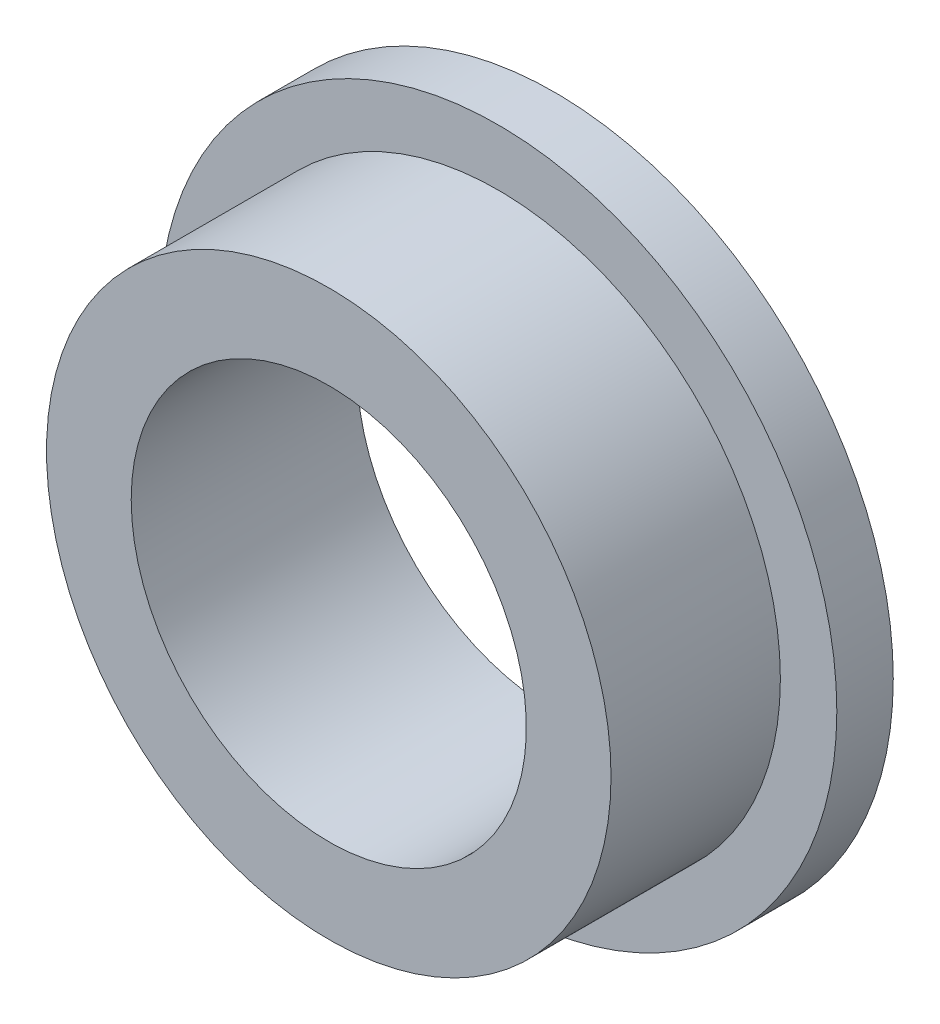
ISO-10303-21;
HEADER;
FILE_DESCRIPTION(('STEP AP214'),'2;1');
FILE_NAME('part.step','',(''),(''),'','','');
FILE_SCHEMA(('AUTOMOTIVE_DESIGN { 1 0 10303 214 1 1 1 1 }'));
ENDSEC;
DATA;
#1=APPLICATION_CONTEXT('core data for automotive mechanical design processes');
#2=APPLICATION_PROTOCOL_DEFINITION('international standard','automotive_design',2000,#1);
#3=PRODUCT_CONTEXT('',#1,'mechanical');
#4=PRODUCT('Part','Part','',(#3));
#5=PRODUCT_RELATED_PRODUCT_CATEGORY('part','',(#4));
#6=PRODUCT_DEFINITION_FORMATION('','',#4);
#7=PRODUCT_DEFINITION_CONTEXT('part definition',#1,'design');
#8=PRODUCT_DEFINITION('design','',#6,#7);
#9=PRODUCT_DEFINITION_SHAPE('','',#8);
#10=(LENGTH_UNIT() NAMED_UNIT(*) SI_UNIT(.MILLI.,.METRE.));
#11=(NAMED_UNIT(*) PLANE_ANGLE_UNIT() SI_UNIT($,.RADIAN.));
#12=(NAMED_UNIT(*) SI_UNIT($,.STERADIAN.) SOLID_ANGLE_UNIT());
#13=UNCERTAINTY_MEASURE_WITH_UNIT(LENGTH_MEASURE(1.E-05),#10,'distance_accuracy_value','');
#14=(GEOMETRIC_REPRESENTATION_CONTEXT(3) GLOBAL_UNCERTAINTY_ASSIGNED_CONTEXT((#13)) GLOBAL_UNIT_ASSIGNED_CONTEXT((#10,
#11,#12)) REPRESENTATION_CONTEXT('',''));
#15=CARTESIAN_POINT('',(0.,0.,0.));
#16=DIRECTION('',(0.,0.,1.));
#17=DIRECTION('',(1.,0.,0.));
#18=AXIS2_PLACEMENT_3D('',#15,#16,#17);
#19=CARTESIAN_POINT('',(0.,0.,1.));
#20=DIRECTION('',(0.,0.,1.));
#21=DIRECTION('',(1.,0.,0.));
#22=AXIS2_PLACEMENT_3D('',#19,#20,#21);
#23=PLANE('',#22);
#24=CARTESIAN_POINT('',(0.,0.,1.));
#25=DIRECTION('',(0.,0.,1.));
#26=DIRECTION('',(1.,0.,0.));
#27=AXIS2_PLACEMENT_3D('',#24,#25,#26);
#28=CIRCLE('',#27,6.);
#29=CARTESIAN_POINT('',(6.,0.,1.));
#30=VERTEX_POINT('',#29);
#31=EDGE_CURVE('E10',#30,#30,#28,.T.);
#32=ORIENTED_EDGE('',*,*,#31,.T.);
#33=EDGE_LOOP('',(#32));
#34=FACE_BOUND('',#33,.T.);
#35=CARTESIAN_POINT('',(0.,0.,1.));
#36=DIRECTION('',(0.,0.,1.));
#37=DIRECTION('',(1.,0.,0.));
#38=AXIS2_PLACEMENT_3D('',#35,#36,#37);
#39=CIRCLE('',#38,5.);
#40=CARTESIAN_POINT('',(5.,0.,1.));
#41=VERTEX_POINT('',#40);
#42=EDGE_CURVE('E47',#41,#41,#39,.T.);
#43=ORIENTED_EDGE('',*,*,#42,.F.);
#44=EDGE_LOOP('',(#43));
#45=FACE_BOUND('',#44,.T.);
#46=ADVANCED_FACE('F34',(#34,#45),#23,.T.);
#47=CARTESIAN_POINT('',(0.,0.,1.));
#48=DIRECTION('',(0.,0.,-1.));
#49=DIRECTION('',(-1.,0.,0.));
#50=AXIS2_PLACEMENT_3D('',#47,#48,#49);
#51=CYLINDRICAL_SURFACE('',#50,6.);
#52=ORIENTED_EDGE('',*,*,#31,.F.);
#53=EDGE_LOOP('',(#52));
#54=FACE_BOUND('',#53,.T.);
#55=CARTESIAN_POINT('',(0.,0.,0.));
#56=DIRECTION('',(0.,0.,1.));
#57=DIRECTION('',(1.,0.,0.));
#58=AXIS2_PLACEMENT_3D('',#55,#56,#57);
#59=CIRCLE('',#58,6.);
#60=CARTESIAN_POINT('',(6.,0.,0.));
#61=VERTEX_POINT('',#60);
#62=EDGE_CURVE('E38',#61,#61,#59,.T.);
#63=ORIENTED_EDGE('',*,*,#62,.T.);
#64=EDGE_LOOP('',(#63));
#65=FACE_BOUND('',#64,.T.);
#66=ADVANCED_FACE('F36',(#54,#65),#51,.T.);
#67=CARTESIAN_POINT('',(0.,0.,0.));
#68=DIRECTION('',(0.,0.,1.));
#69=DIRECTION('',(1.,0.,0.));
#70=AXIS2_PLACEMENT_3D('',#67,#68,#69);
#71=PLANE('',#70);
#72=CARTESIAN_POINT('',(0.,0.,0.));
#73=DIRECTION('',(0.,0.,-1.));
#74=DIRECTION('',(-1.,0.,0.));
#75=AXIS2_PLACEMENT_3D('',#72,#73,#74);
#76=CIRCLE('',#75,3.5);
#77=CARTESIAN_POINT('',(-3.5,0.,0.));
#78=VERTEX_POINT('',#77);
#79=EDGE_CURVE('E53',#78,#78,#76,.T.);
#80=ORIENTED_EDGE('',*,*,#79,.F.);
#81=EDGE_LOOP('',(#80));
#82=FACE_BOUND('',#81,.T.);
#83=ORIENTED_EDGE('',*,*,#62,.F.);
#84=EDGE_LOOP('',(#83));
#85=FACE_BOUND('',#84,.T.);
#86=ADVANCED_FACE('F68',(#82,#85),#71,.F.);
#87=CARTESIAN_POINT('',(0.,0.,4.));
#88=DIRECTION('',(0.,0.,-1.));
#89=DIRECTION('',(-1.,0.,0.));
#90=AXIS2_PLACEMENT_3D('',#87,#88,#89);
#91=CYLINDRICAL_SURFACE('',#90,5.);
#92=CARTESIAN_POINT('',(0.,0.,4.));
#93=DIRECTION('',(0.,0.,1.));
#94=DIRECTION('',(1.,0.,0.));
#95=AXIS2_PLACEMENT_3D('',#92,#93,#94);
#96=CIRCLE('',#95,5.);
#97=CARTESIAN_POINT('',(5.,0.,4.));
#98=VERTEX_POINT('',#97);
#99=EDGE_CURVE('E45',#98,#98,#96,.T.);
#100=ORIENTED_EDGE('',*,*,#99,.F.);
#101=EDGE_LOOP('',(#100));
#102=FACE_BOUND('',#101,.T.);
#103=ORIENTED_EDGE('',*,*,#42,.T.);
#104=EDGE_LOOP('',(#103));
#105=FACE_BOUND('',#104,.T.);
#106=ADVANCED_FACE('F71',(#102,#105),#91,.T.);
#107=CARTESIAN_POINT('',(0.,0.,4.));
#108=DIRECTION('',(0.,0.,1.));
#109=DIRECTION('',(1.,0.,0.));
#110=AXIS2_PLACEMENT_3D('',#107,#108,#109);
#111=PLANE('',#110);
#112=CARTESIAN_POINT('',(0.,0.,4.));
#113=DIRECTION('',(0.,0.,-1.));
#114=DIRECTION('',(-1.,0.,0.));
#115=AXIS2_PLACEMENT_3D('',#112,#113,#114);
#116=CIRCLE('',#115,3.5);
#117=CARTESIAN_POINT('',(-3.5,0.,4.));
#118=VERTEX_POINT('',#117);
#119=EDGE_CURVE('E50',#118,#118,#116,.T.);
#120=ORIENTED_EDGE('',*,*,#119,.T.);
#121=EDGE_LOOP('',(#120));
#122=FACE_BOUND('',#121,.T.);
#123=ORIENTED_EDGE('',*,*,#99,.T.);
#124=EDGE_LOOP('',(#123));
#125=FACE_BOUND('',#124,.T.);
#126=ADVANCED_FACE('F59',(#122,#125),#111,.T.);
#127=CARTESIAN_POINT('',(0.,0.,4.));
#128=DIRECTION('',(0.,0.,-1.));
#129=DIRECTION('',(-1.,0.,0.));
#130=AXIS2_PLACEMENT_3D('',#127,#128,#129);
#131=CYLINDRICAL_SURFACE('',#130,3.5);
#132=ORIENTED_EDGE('',*,*,#119,.F.);
#133=EDGE_LOOP('',(#132));
#134=FACE_BOUND('',#133,.T.);
#135=ORIENTED_EDGE('',*,*,#79,.T.);
#136=EDGE_LOOP('',(#135));
#137=FACE_BOUND('',#136,.T.);
#138=ADVANCED_FACE('F62',(#134,#137),#131,.F.);
#139=CLOSED_SHELL('',(#46,#66,#86,#106,#126,#138));
#140=MANIFOLD_SOLID_BREP('B2',#139);
#141=ADVANCED_BREP_SHAPE_REPRESENTATION('',(#18,#140),#14);
#142=SHAPE_DEFINITION_REPRESENTATION(#9,#141);
ENDSEC;
END-ISO-10303-21;
